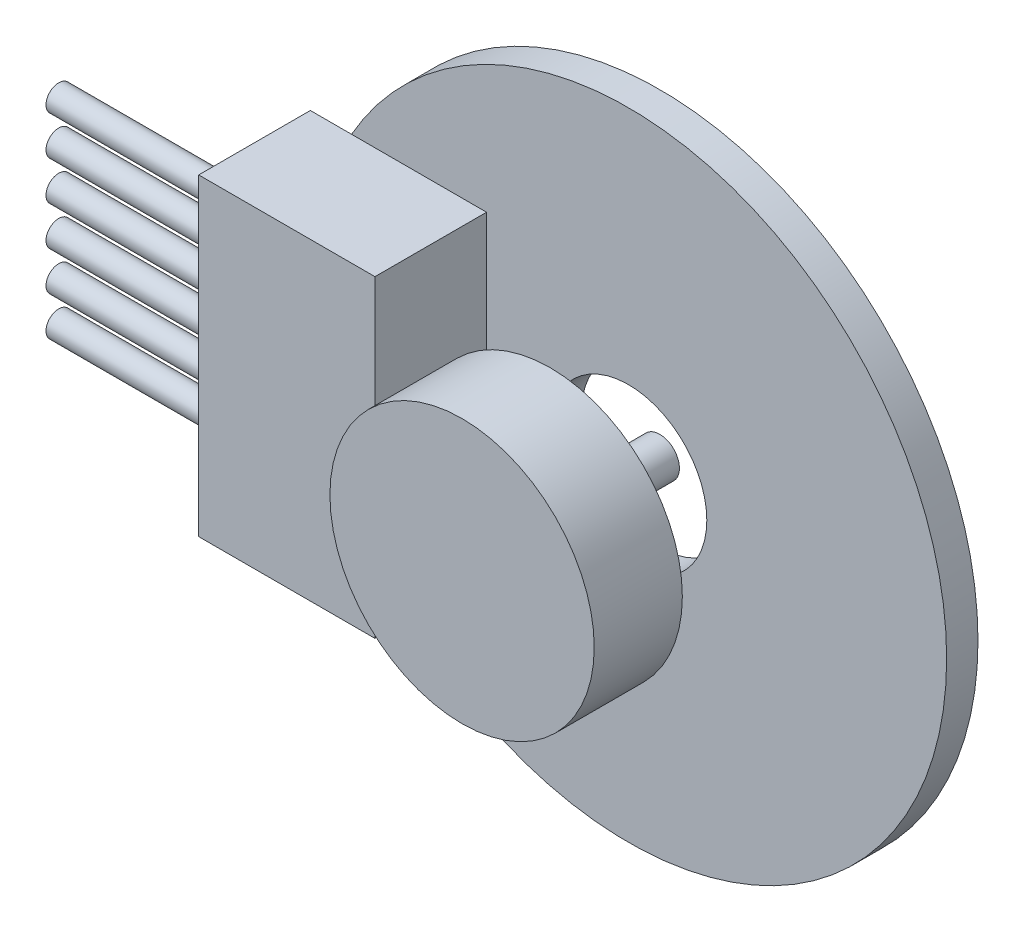
ISO-10303-21;
HEADER;
FILE_DESCRIPTION(('STEP AP214'),'2;1');
FILE_NAME('part.step','',(''),(''),'','','');
FILE_SCHEMA(('AUTOMOTIVE_DESIGN { 1 0 10303 214 1 1 1 1 }'));
ENDSEC;
DATA;
#1=APPLICATION_CONTEXT('core data for automotive mechanical design processes');
#2=APPLICATION_PROTOCOL_DEFINITION('international standard','automotive_design',2000,#1);
#3=PRODUCT_CONTEXT('',#1,'mechanical');
#4=PRODUCT('Part','Part','',(#3));
#5=PRODUCT_RELATED_PRODUCT_CATEGORY('part','',(#4));
#6=PRODUCT_DEFINITION_FORMATION('','',#4);
#7=PRODUCT_DEFINITION_CONTEXT('part definition',#1,'design');
#8=PRODUCT_DEFINITION('design','',#6,#7);
#9=PRODUCT_DEFINITION_SHAPE('','',#8);
#10=(LENGTH_UNIT() NAMED_UNIT(*) SI_UNIT(.MILLI.,.METRE.));
#11=(NAMED_UNIT(*) PLANE_ANGLE_UNIT() SI_UNIT($,.RADIAN.));
#12=(NAMED_UNIT(*) SI_UNIT($,.STERADIAN.) SOLID_ANGLE_UNIT());
#13=UNCERTAINTY_MEASURE_WITH_UNIT(LENGTH_MEASURE(1.E-05),#10,'distance_accuracy_value','');
#14=(GEOMETRIC_REPRESENTATION_CONTEXT(3) GLOBAL_UNCERTAINTY_ASSIGNED_CONTEXT((#13)) GLOBAL_UNIT_ASSIGNED_CONTEXT((#10,
#11,#12)) REPRESENTATION_CONTEXT('',''));
#15=CARTESIAN_POINT('',(0.,0.,0.));
#16=DIRECTION('',(0.,0.,1.));
#17=DIRECTION('',(1.,0.,0.));
#18=AXIS2_PLACEMENT_3D('',#15,#16,#17);
#19=CARTESIAN_POINT('',(0.,0.,5.6));
#20=DIRECTION('',(0.,0.,1.));
#21=DIRECTION('',(1.,0.,0.));
#22=AXIS2_PLACEMENT_3D('',#19,#20,#21);
#23=CYLINDRICAL_SURFACE('',#22,6.75);
#24=CARTESIAN_POINT('',(0.,0.,5.6));
#25=DIRECTION('',(0.,0.,1.));
#26=DIRECTION('',(1.,0.,0.));
#27=AXIS2_PLACEMENT_3D('',#24,#25,#26);
#28=CIRCLE('',#27,6.75);
#29=CARTESIAN_POINT('',(6.75,0.,5.6));
#30=VERTEX_POINT('',#29);
#31=EDGE_CURVE('E54',#30,#30,#28,.T.);
#32=ORIENTED_EDGE('',*,*,#31,.T.);
#33=EDGE_LOOP('',(#32));
#34=FACE_BOUND('',#33,.T.);
#35=CARTESIAN_POINT('',(0.,0.,10.1));
#36=DIRECTION('',(0.,0.,1.));
#37=DIRECTION('',(1.,0.,0.));
#38=AXIS2_PLACEMENT_3D('',#35,#36,#37);
#39=CIRCLE('',#38,6.75);
#40=CARTESIAN_POINT('',(6.75,0.,10.1));
#41=VERTEX_POINT('',#40);
#42=EDGE_CURVE('E50',#41,#41,#39,.T.);
#43=ORIENTED_EDGE('',*,*,#42,.F.);
#44=EDGE_LOOP('',(#43));
#45=FACE_BOUND('',#44,.T.);
#46=ADVANCED_FACE('F47',(#34,#45),#23,.T.);
#47=CARTESIAN_POINT('',(0.,0.,5.6));
#48=DIRECTION('',(0.,0.,1.));
#49=DIRECTION('',(1.,0.,0.));
#50=AXIS2_PLACEMENT_3D('',#47,#48,#49);
#51=PLANE('',#50);
#52=CARTESIAN_POINT('',(0.,0.,5.6));
#53=DIRECTION('',(0.,0.,-1.));
#54=DIRECTION('',(-1.,0.,0.));
#55=AXIS2_PLACEMENT_3D('',#52,#53,#54);
#56=CIRCLE('',#55,1.);
#57=CARTESIAN_POINT('',(-1.,0.,5.6));
#58=VERTEX_POINT('',#57);
#59=EDGE_CURVE('E11',#58,#58,#56,.T.);
#60=ORIENTED_EDGE('',*,*,#59,.F.);
#61=EDGE_LOOP('',(#60));
#62=FACE_BOUND('',#61,.T.);
#63=ORIENTED_EDGE('',*,*,#31,.F.);
#64=EDGE_LOOP('',(#63));
#65=FACE_BOUND('',#64,.T.);
#66=ADVANCED_FACE('F70',(#62,#65),#51,.F.);
#67=CARTESIAN_POINT('',(0.,0.,10.1));
#68=DIRECTION('',(0.,0.,1.));
#69=DIRECTION('',(1.,0.,0.));
#70=AXIS2_PLACEMENT_3D('',#67,#68,#69);
#71=PLANE('',#70);
#72=ORIENTED_EDGE('',*,*,#42,.T.);
#73=EDGE_LOOP('',(#72));
#74=FACE_BOUND('',#73,.T.);
#75=ADVANCED_FACE('F67',(#74),#71,.T.);
#76=CARTESIAN_POINT('',(0.,0.,-2.82842712474619));
#77=DIRECTION('',(0.,0.,1.));
#78=DIRECTION('',(1.,0.,0.));
#79=AXIS2_PLACEMENT_3D('',#76,#77,#78);
#80=CYLINDRICAL_SURFACE('',#79,1.);
#81=CARTESIAN_POINT('',(0.,0.,0.));
#82=DIRECTION('',(0.,0.,1.));
#83=DIRECTION('',(1.,0.,0.));
#84=AXIS2_PLACEMENT_3D('',#81,#82,#83);
#85=CIRCLE('',#84,1.);
#86=CARTESIAN_POINT('',(1.,0.,0.));
#87=VERTEX_POINT('',#86);
#88=EDGE_CURVE('E60',#87,#87,#85,.T.);
#89=ORIENTED_EDGE('',*,*,#88,.T.);
#90=EDGE_LOOP('',(#89));
#91=FACE_BOUND('',#90,.T.);
#92=ORIENTED_EDGE('',*,*,#59,.T.);
#93=EDGE_LOOP('',(#92));
#94=FACE_BOUND('',#93,.T.);
#95=ADVANCED_FACE('F82',(#91,#94),#80,.T.);
#96=CARTESIAN_POINT('',(0.,0.,0.));
#97=DIRECTION('',(0.,0.,1.));
#98=DIRECTION('',(1.,0.,0.));
#99=AXIS2_PLACEMENT_3D('',#96,#97,#98);
#100=PLANE('',#99);
#101=ORIENTED_EDGE('',*,*,#88,.F.);
#102=EDGE_LOOP('',(#101));
#103=FACE_BOUND('',#102,.T.);
#104=ADVANCED_FACE('F86',(#103),#100,.F.);
#105=CLOSED_SHELL('',(#46,#66,#75,#95,#104));
#106=MANIFOLD_SOLID_BREP('B2',#105);
#107=CARTESIAN_POINT('',(0.,0.,1.6));
#108=DIRECTION('',(0.,0.,1.));
#109=DIRECTION('',(1.,0.,0.));
#110=AXIS2_PLACEMENT_3D('',#107,#108,#109);
#111=PLANE('',#110);
#112=DIRECTION('',(1.,0.,0.));
#113=VECTOR('',#112,1.);
#114=CARTESIAN_POINT('',(-16.25,-8.,1.6));
#115=LINE('',#114,#113);
#116=CARTESIAN_POINT('',(-14.1443451598156,-8.,1.6));
#117=VERTEX_POINT('',#116);
#118=CARTESIAN_POINT('',(-7.25,-8.,1.6));
#119=VERTEX_POINT('',#118);
#120=EDGE_CURVE('E213',#117,#119,#115,.T.);
#121=ORIENTED_EDGE('',*,*,#120,.F.);
#122=CARTESIAN_POINT('',(0.,0.,1.6));
#123=DIRECTION('',(0.,0.,1.));
#124=DIRECTION('',(1.,0.,0.));
#125=AXIS2_PLACEMENT_3D('',#122,#123,#124);
#126=CIRCLE('',#125,16.25);
#127=CARTESIAN_POINT('',(-14.1443451598156,8.,1.6));
#128=VERTEX_POINT('',#127);
#129=EDGE_CURVE('E215',#117,#128,#126,.T.);
#130=ORIENTED_EDGE('',*,*,#129,.T.);
#131=DIRECTION('',(-1.,0.,0.));
#132=VECTOR('',#131,1.);
#133=CARTESIAN_POINT('',(-16.25,8.,1.6));
#134=LINE('',#133,#132);
#135=CARTESIAN_POINT('',(-7.25,8.,1.6));
#136=VERTEX_POINT('',#135);
#137=EDGE_CURVE('E147',#136,#128,#134,.T.);
#138=ORIENTED_EDGE('',*,*,#137,.F.);
#139=DIRECTION('',(0.,1.,0.));
#140=VECTOR('',#139,1.);
#141=CARTESIAN_POINT('',(-7.25,-8.,1.6));
#142=LINE('',#141,#140);
#143=EDGE_CURVE('E142',#119,#136,#142,.T.);
#144=ORIENTED_EDGE('',*,*,#143,.F.);
#145=EDGE_LOOP('',(#121,#130,#138,#144));
#146=FACE_BOUND('',#145,.T.);
#147=CARTESIAN_POINT('',(0.,0.,1.6));
#148=DIRECTION('',(0.,0.,1.));
#149=DIRECTION('',(1.,0.,0.));
#150=AXIS2_PLACEMENT_3D('',#147,#148,#149);
#151=CIRCLE('',#150,4.);
#152=CARTESIAN_POINT('',(4.,0.,1.6));
#153=VERTEX_POINT('',#152);
#154=EDGE_CURVE('E201',#153,#153,#151,.T.);
#155=ORIENTED_EDGE('',*,*,#154,.F.);
#156=EDGE_LOOP('',(#155));
#157=FACE_BOUND('',#156,.T.);
#158=ADVANCED_FACE('F127',(#146,#157),#111,.T.);
#159=CARTESIAN_POINT('',(0.,0.,0.));
#160=DIRECTION('',(0.,0.,1.));
#161=DIRECTION('',(1.,0.,0.));
#162=AXIS2_PLACEMENT_3D('',#159,#160,#161);
#163=PLANE('',#162);
#164=CARTESIAN_POINT('',(0.,0.,0.));
#165=DIRECTION('',(0.,0.,1.));
#166=DIRECTION('',(1.,0.,0.));
#167=AXIS2_PLACEMENT_3D('',#164,#165,#166);
#168=CIRCLE('',#167,16.25);
#169=CARTESIAN_POINT('',(16.25,0.,0.));
#170=VERTEX_POINT('',#169);
#171=EDGE_CURVE('E208',#170,#170,#168,.T.);
#172=ORIENTED_EDGE('',*,*,#171,.F.);
#173=EDGE_LOOP('',(#172));
#174=FACE_BOUND('',#173,.T.);
#175=CARTESIAN_POINT('',(0.,0.,0.));
#176=DIRECTION('',(0.,0.,1.));
#177=DIRECTION('',(1.,0.,0.));
#178=AXIS2_PLACEMENT_3D('',#175,#176,#177);
#179=CIRCLE('',#178,4.);
#180=CARTESIAN_POINT('',(4.,0.,0.));
#181=VERTEX_POINT('',#180);
#182=EDGE_CURVE('E198',#181,#181,#179,.T.);
#183=ORIENTED_EDGE('',*,*,#182,.T.);
#184=EDGE_LOOP('',(#183));
#185=FACE_BOUND('',#184,.T.);
#186=ADVANCED_FACE('F312',(#174,#185),#163,.F.);
#187=CARTESIAN_POINT('',(0.,0.,1.6));
#188=DIRECTION('',(0.,0.,-1.));
#189=DIRECTION('',(-1.,0.,0.));
#190=AXIS2_PLACEMENT_3D('',#187,#188,#189);
#191=CYLINDRICAL_SURFACE('',#190,16.25);
#192=CARTESIAN_POINT('',(-16.25,0.,1.6));
#193=VERTEX_POINT('',#192);
#194=EDGE_CURVE('E210',#128,#193,#126,.T.);
#195=ORIENTED_EDGE('',*,*,#194,.F.);
#196=ORIENTED_EDGE('',*,*,#129,.F.);
#197=EDGE_CURVE('E214',#193,#117,#126,.T.);
#198=ORIENTED_EDGE('',*,*,#197,.F.);
#199=EDGE_LOOP('',(#195,#196,#198));
#200=FACE_BOUND('',#199,.T.);
#201=ORIENTED_EDGE('',*,*,#171,.T.);
#202=EDGE_LOOP('',(#201));
#203=FACE_BOUND('',#202,.T.);
#204=ADVANCED_FACE('F129',(#200,#203),#191,.T.);
#205=CARTESIAN_POINT('',(0.,0.,1.6));
#206=DIRECTION('',(0.,0.,-1.));
#207=DIRECTION('',(-1.,0.,0.));
#208=AXIS2_PLACEMENT_3D('',#205,#206,#207);
#209=CYLINDRICAL_SURFACE('',#208,4.);
#210=ORIENTED_EDGE('',*,*,#154,.T.);
#211=EDGE_LOOP('',(#210));
#212=FACE_BOUND('',#211,.T.);
#213=ORIENTED_EDGE('',*,*,#182,.F.);
#214=EDGE_LOOP('',(#213));
#215=FACE_BOUND('',#214,.T.);
#216=ADVANCED_FACE('F319',(#212,#215),#209,.F.);
#217=CARTESIAN_POINT('',(0.,0.,1.6));
#218=DIRECTION('',(0.,0.,-1.));
#219=DIRECTION('',(-1.,0.,0.));
#220=AXIS2_PLACEMENT_3D('',#217,#218,#219);
#221=PLANE('',#220);
#222=CARTESIAN_POINT('',(-16.25,8.,1.6));
#223=VERTEX_POINT('',#222);
#224=EDGE_CURVE('E272',#128,#223,#134,.T.);
#225=ORIENTED_EDGE('',*,*,#224,.F.);
#226=ORIENTED_EDGE('',*,*,#194,.T.);
#227=DIRECTION('',(0.,-1.,0.));
#228=VECTOR('',#227,1.);
#229=CARTESIAN_POINT('',(-16.25,-8.,1.6));
#230=LINE('',#229,#228);
#231=EDGE_CURVE('E250',#223,#193,#230,.T.);
#232=ORIENTED_EDGE('',*,*,#231,.F.);
#233=EDGE_LOOP('',(#225,#226,#232));
#234=FACE_BOUND('',#233,.T.);
#235=ADVANCED_FACE('F273',(#234),#221,.T.);
#236=CARTESIAN_POINT('',(-7.25,-8.,7.3));
#237=DIRECTION('',(-1.,0.,0.));
#238=DIRECTION('',(0.,0.,1.));
#239=AXIS2_PLACEMENT_3D('',#236,#237,#238);
#240=PLANE('',#239);
#241=ORIENTED_EDGE('',*,*,#143,.T.);
#242=DIRECTION('',(0.,0.,-1.));
#243=VECTOR('',#242,1.);
#244=CARTESIAN_POINT('',(-7.25,8.,7.3));
#245=LINE('',#244,#243);
#246=CARTESIAN_POINT('',(-7.25,8.,7.3));
#247=VERTEX_POINT('',#246);
#248=EDGE_CURVE('E180',#247,#136,#245,.T.);
#249=ORIENTED_EDGE('',*,*,#248,.F.);
#250=DIRECTION('',(0.,1.,0.));
#251=VECTOR('',#250,1.);
#252=CARTESIAN_POINT('',(-7.25,-8.,7.3));
#253=LINE('',#252,#251);
#254=CARTESIAN_POINT('',(-7.25,-8.,7.3));
#255=VERTEX_POINT('',#254);
#256=EDGE_CURVE('E186',#255,#247,#253,.T.);
#257=ORIENTED_EDGE('',*,*,#256,.F.);
#258=DIRECTION('',(0.,0.,-1.));
#259=VECTOR('',#258,1.);
#260=CARTESIAN_POINT('',(-7.25,-8.,7.3));
#261=LINE('',#260,#259);
#262=EDGE_CURVE('E263',#255,#119,#261,.T.);
#263=ORIENTED_EDGE('',*,*,#262,.T.);
#264=EDGE_LOOP('',(#241,#249,#257,#263));
#265=FACE_BOUND('',#264,.T.);
#266=ADVANCED_FACE('F197',(#265),#240,.F.);
#267=CARTESIAN_POINT('',(-16.25,8.,7.3));
#268=DIRECTION('',(0.,-1.,0.));
#269=DIRECTION('',(0.,0.,-1.));
#270=AXIS2_PLACEMENT_3D('',#267,#268,#269);
#271=PLANE('',#270);
#272=ORIENTED_EDGE('',*,*,#137,.T.);
#273=ORIENTED_EDGE('',*,*,#224,.T.);
#274=DIRECTION('',(0.,0.,-1.));
#275=VECTOR('',#274,1.);
#276=CARTESIAN_POINT('',(-16.25,8.,7.3));
#277=LINE('',#276,#275);
#278=CARTESIAN_POINT('',(-16.25,8.,7.3));
#279=VERTEX_POINT('',#278);
#280=EDGE_CURVE('E182',#279,#223,#277,.T.);
#281=ORIENTED_EDGE('',*,*,#280,.F.);
#282=DIRECTION('',(-1.,0.,0.));
#283=VECTOR('',#282,1.);
#284=CARTESIAN_POINT('',(-16.25,8.,7.3));
#285=LINE('',#284,#283);
#286=EDGE_CURVE('E176',#247,#279,#285,.T.);
#287=ORIENTED_EDGE('',*,*,#286,.F.);
#288=ORIENTED_EDGE('',*,*,#248,.T.);
#289=EDGE_LOOP('',(#272,#273,#281,#287,#288));
#290=FACE_BOUND('',#289,.T.);
#291=ADVANCED_FACE('F178',(#290),#271,.F.);
#292=CARTESIAN_POINT('',(-16.25,-8.,7.3));
#293=DIRECTION('',(1.,0.,0.));
#294=DIRECTION('',(0.,0.,-1.));
#295=AXIS2_PLACEMENT_3D('',#292,#293,#294);
#296=PLANE('',#295);
#297=CARTESIAN_POINT('',(-16.25,-5.,4.45000000000004));
#298=DIRECTION('',(1.,0.,0.));
#299=DIRECTION('',(0.,0.,-1.));
#300=AXIS2_PLACEMENT_3D('',#297,#298,#299);
#301=CIRCLE('',#300,0.65);
#302=CARTESIAN_POINT('',(-16.25,-5.,3.80000000000004));
#303=VERTEX_POINT('',#302);
#304=EDGE_CURVE('E45',#303,#303,#301,.F.);
#305=ORIENTED_EDGE('',*,*,#304,.F.);
#306=EDGE_LOOP('',(#305));
#307=FACE_BOUND('',#306,.T.);
#308=CARTESIAN_POINT('',(-16.25,-3.,4.45000000000002));
#309=DIRECTION('',(1.,0.,0.));
#310=DIRECTION('',(0.,0.,-1.));
#311=AXIS2_PLACEMENT_3D('',#308,#309,#310);
#312=CIRCLE('',#311,0.65);
#313=CARTESIAN_POINT('',(-16.25,-3.,3.80000000000002));
#314=VERTEX_POINT('',#313);
#315=EDGE_CURVE('E135',#314,#314,#312,.F.);
#316=ORIENTED_EDGE('',*,*,#315,.F.);
#317=EDGE_LOOP('',(#316));
#318=FACE_BOUND('',#317,.T.);
#319=CARTESIAN_POINT('',(-16.25,-1.,4.45));
#320=DIRECTION('',(1.,0.,0.));
#321=DIRECTION('',(0.,0.,-1.));
#322=AXIS2_PLACEMENT_3D('',#319,#320,#321);
#323=CIRCLE('',#322,0.65);
#324=CARTESIAN_POINT('',(-16.25,-1.,3.8));
#325=VERTEX_POINT('',#324);
#326=EDGE_CURVE('E227',#325,#325,#323,.F.);
#327=ORIENTED_EDGE('',*,*,#326,.F.);
#328=EDGE_LOOP('',(#327));
#329=FACE_BOUND('',#328,.T.);
#330=CARTESIAN_POINT('',(-16.25,0.999999999999997,4.44999999999998));
#331=DIRECTION('',(1.,0.,0.));
#332=DIRECTION('',(0.,0.,-1.));
#333=AXIS2_PLACEMENT_3D('',#330,#331,#332);
#334=CIRCLE('',#333,0.65);
#335=CARTESIAN_POINT('',(-16.25,0.999999999999997,3.79999999999998));
#336=VERTEX_POINT('',#335);
#337=EDGE_CURVE('E224',#336,#336,#334,.F.);
#338=ORIENTED_EDGE('',*,*,#337,.F.);
#339=EDGE_LOOP('',(#338));
#340=FACE_BOUND('',#339,.T.);
#341=CARTESIAN_POINT('',(-16.25,3.,4.44999999999996));
#342=DIRECTION('',(1.,0.,0.));
#343=DIRECTION('',(0.,0.,-1.));
#344=AXIS2_PLACEMENT_3D('',#341,#342,#343);
#345=CIRCLE('',#344,0.65);
#346=CARTESIAN_POINT('',(-16.25,3.,3.79999999999996));
#347=VERTEX_POINT('',#346);
#348=EDGE_CURVE('E221',#347,#347,#345,.F.);
#349=ORIENTED_EDGE('',*,*,#348,.F.);
#350=EDGE_LOOP('',(#349));
#351=FACE_BOUND('',#350,.T.);
#352=CARTESIAN_POINT('',(-16.25,5.,4.44999999999994));
#353=DIRECTION('',(1.,0.,0.));
#354=DIRECTION('',(0.,0.,-1.));
#355=AXIS2_PLACEMENT_3D('',#352,#353,#354);
#356=CIRCLE('',#355,0.65);
#357=CARTESIAN_POINT('',(-16.25,5.,3.79999999999994));
#358=VERTEX_POINT('',#357);
#359=EDGE_CURVE('E218',#358,#358,#356,.F.);
#360=ORIENTED_EDGE('',*,*,#359,.F.);
#361=EDGE_LOOP('',(#360));
#362=FACE_BOUND('',#361,.T.);
#363=ORIENTED_EDGE('',*,*,#231,.T.);
#364=CARTESIAN_POINT('',(-16.25,-8.,1.6));
#365=VERTEX_POINT('',#364);
#366=EDGE_CURVE('E253',#193,#365,#230,.T.);
#367=ORIENTED_EDGE('',*,*,#366,.T.);
#368=DIRECTION('',(0.,0.,-1.));
#369=VECTOR('',#368,1.);
#370=CARTESIAN_POINT('',(-16.25,-8.,7.3));
#371=LINE('',#370,#369);
#372=CARTESIAN_POINT('',(-16.25,-8.,7.3));
#373=VERTEX_POINT('',#372);
#374=EDGE_CURVE('E203',#373,#365,#371,.T.);
#375=ORIENTED_EDGE('',*,*,#374,.F.);
#376=DIRECTION('',(0.,-1.,0.));
#377=VECTOR('',#376,1.);
#378=CARTESIAN_POINT('',(-16.25,-8.,7.3));
#379=LINE('',#378,#377);
#380=EDGE_CURVE('E185',#279,#373,#379,.T.);
#381=ORIENTED_EDGE('',*,*,#380,.F.);
#382=ORIENTED_EDGE('',*,*,#280,.T.);
#383=EDGE_LOOP('',(#363,#367,#375,#381,#382));
#384=FACE_BOUND('',#383,.T.);
#385=ADVANCED_FACE('F234',(#307,#318,#329,#340,#351,#362,#384),#296,.F.);
#386=CARTESIAN_POINT('',(-16.25,-8.,7.3));
#387=DIRECTION('',(0.,1.,0.));
#388=DIRECTION('',(0.,0.,1.));
#389=AXIS2_PLACEMENT_3D('',#386,#387,#388);
#390=PLANE('',#389);
#391=EDGE_CURVE('E195',#365,#117,#115,.T.);
#392=ORIENTED_EDGE('',*,*,#391,.T.);
#393=ORIENTED_EDGE('',*,*,#120,.T.);
#394=ORIENTED_EDGE('',*,*,#262,.F.);
#395=DIRECTION('',(1.,0.,0.));
#396=VECTOR('',#395,1.);
#397=CARTESIAN_POINT('',(-16.25,-8.,7.3));
#398=LINE('',#397,#396);
#399=EDGE_CURVE('E191',#373,#255,#398,.T.);
#400=ORIENTED_EDGE('',*,*,#399,.F.);
#401=ORIENTED_EDGE('',*,*,#374,.T.);
#402=EDGE_LOOP('',(#392,#393,#394,#400,#401));
#403=FACE_BOUND('',#402,.T.);
#404=ADVANCED_FACE('F237',(#403),#390,.F.);
#405=CARTESIAN_POINT('',(0.,0.,7.3));
#406=DIRECTION('',(0.,0.,-1.));
#407=DIRECTION('',(-1.,0.,0.));
#408=AXIS2_PLACEMENT_3D('',#405,#406,#407);
#409=PLANE('',#408);
#410=ORIENTED_EDGE('',*,*,#256,.T.);
#411=ORIENTED_EDGE('',*,*,#286,.T.);
#412=ORIENTED_EDGE('',*,*,#380,.T.);
#413=ORIENTED_EDGE('',*,*,#399,.T.);
#414=EDGE_LOOP('',(#410,#411,#412,#413));
#415=FACE_BOUND('',#414,.T.);
#416=ADVANCED_FACE('F189',(#415),#409,.F.);
#417=ORIENTED_EDGE('',*,*,#366,.F.);
#418=ORIENTED_EDGE('',*,*,#197,.T.);
#419=ORIENTED_EDGE('',*,*,#391,.F.);
#420=EDGE_LOOP('',(#417,#418,#419));
#421=FACE_BOUND('',#420,.T.);
#422=ADVANCED_FACE('F268',(#421),#221,.T.);
#423=CARTESIAN_POINT('',(-26.25,5.,4.44999999999994));
#424=DIRECTION('',(1.,0.,0.));
#425=DIRECTION('',(0.,0.,-1.));
#426=AXIS2_PLACEMENT_3D('',#423,#424,#425);
#427=CYLINDRICAL_SURFACE('',#426,0.65);
#428=CARTESIAN_POINT('',(-26.25,5.,4.44999999999994));
#429=DIRECTION('',(-1.,0.,0.));
#430=DIRECTION('',(0.,0.,1.));
#431=AXIS2_PLACEMENT_3D('',#428,#429,#430);
#432=CIRCLE('',#431,0.65);
#433=CARTESIAN_POINT('',(-26.25,5.,5.09999999999994));
#434=VERTEX_POINT('',#433);
#435=EDGE_CURVE('E274',#434,#434,#432,.T.);
#436=ORIENTED_EDGE('',*,*,#435,.F.);
#437=EDGE_LOOP('',(#436));
#438=FACE_BOUND('',#437,.T.);
#439=ORIENTED_EDGE('',*,*,#359,.T.);
#440=EDGE_LOOP('',(#439));
#441=FACE_BOUND('',#440,.T.);
#442=ADVANCED_FACE('F331',(#438,#441),#427,.T.);
#443=CARTESIAN_POINT('',(-26.25,5.,4.44999999999994));
#444=DIRECTION('',(-1.,0.,0.));
#445=DIRECTION('',(0.,0.,1.));
#446=AXIS2_PLACEMENT_3D('',#443,#444,#445);
#447=PLANE('',#446);
#448=ORIENTED_EDGE('',*,*,#435,.T.);
#449=EDGE_LOOP('',(#448));
#450=FACE_BOUND('',#449,.T.);
#451=ADVANCED_FACE('F336',(#450),#447,.T.);
#452=CARTESIAN_POINT('',(-26.25,3.,4.44999999999996));
#453=DIRECTION('',(1.,0.,0.));
#454=DIRECTION('',(0.,0.,-1.));
#455=AXIS2_PLACEMENT_3D('',#452,#453,#454);
#456=CYLINDRICAL_SURFACE('',#455,0.65);
#457=CARTESIAN_POINT('',(-26.25,3.,4.44999999999996));
#458=DIRECTION('',(-1.,0.,0.));
#459=DIRECTION('',(0.,0.,1.));
#460=AXIS2_PLACEMENT_3D('',#457,#458,#459);
#461=CIRCLE('',#460,0.65);
#462=CARTESIAN_POINT('',(-26.25,3.,5.09999999999996));
#463=VERTEX_POINT('',#462);
#464=EDGE_CURVE('E276',#463,#463,#461,.T.);
#465=ORIENTED_EDGE('',*,*,#464,.F.);
#466=EDGE_LOOP('',(#465));
#467=FACE_BOUND('',#466,.T.);
#468=ORIENTED_EDGE('',*,*,#348,.T.);
#469=EDGE_LOOP('',(#468));
#470=FACE_BOUND('',#469,.T.);
#471=ADVANCED_FACE('F340',(#467,#470),#456,.T.);
#472=CARTESIAN_POINT('',(-26.25,3.,4.44999999999996));
#473=DIRECTION('',(-1.,0.,0.));
#474=DIRECTION('',(0.,0.,1.));
#475=AXIS2_PLACEMENT_3D('',#472,#473,#474);
#476=PLANE('',#475);
#477=ORIENTED_EDGE('',*,*,#464,.T.);
#478=EDGE_LOOP('',(#477));
#479=FACE_BOUND('',#478,.T.);
#480=ADVANCED_FACE('F342',(#479),#476,.T.);
#481=CARTESIAN_POINT('',(-26.25,0.999999999999997,4.44999999999998));
#482=DIRECTION('',(1.,0.,0.));
#483=DIRECTION('',(0.,0.,-1.));
#484=AXIS2_PLACEMENT_3D('',#481,#482,#483);
#485=CYLINDRICAL_SURFACE('',#484,0.65);
#486=CARTESIAN_POINT('',(-26.25,0.999999999999997,4.44999999999998));
#487=DIRECTION('',(-1.,0.,0.));
#488=DIRECTION('',(0.,0.,1.));
#489=AXIS2_PLACEMENT_3D('',#486,#487,#488);
#490=CIRCLE('',#489,0.65);
#491=CARTESIAN_POINT('',(-26.25,0.999999999999997,5.09999999999998));
#492=VERTEX_POINT('',#491);
#493=EDGE_CURVE('E283',#492,#492,#490,.T.);
#494=ORIENTED_EDGE('',*,*,#493,.F.);
#495=EDGE_LOOP('',(#494));
#496=FACE_BOUND('',#495,.T.);
#497=ORIENTED_EDGE('',*,*,#337,.T.);
#498=EDGE_LOOP('',(#497));
#499=FACE_BOUND('',#498,.T.);
#500=ADVANCED_FACE('F345',(#496,#499),#485,.T.);
#501=CARTESIAN_POINT('',(-26.25,0.999999999999997,4.44999999999998));
#502=DIRECTION('',(-1.,0.,0.));
#503=DIRECTION('',(0.,0.,1.));
#504=AXIS2_PLACEMENT_3D('',#501,#502,#503);
#505=PLANE('',#504);
#506=ORIENTED_EDGE('',*,*,#493,.T.);
#507=EDGE_LOOP('',(#506));
#508=FACE_BOUND('',#507,.T.);
#509=ADVANCED_FACE('F350',(#508),#505,.T.);
#510=CARTESIAN_POINT('',(-26.25,-1.,4.45));
#511=DIRECTION('',(1.,0.,0.));
#512=DIRECTION('',(0.,0.,-1.));
#513=AXIS2_PLACEMENT_3D('',#510,#511,#512);
#514=CYLINDRICAL_SURFACE('',#513,0.65);
#515=CARTESIAN_POINT('',(-26.25,-1.,4.45));
#516=DIRECTION('',(-1.,0.,0.));
#517=DIRECTION('',(0.,0.,1.));
#518=AXIS2_PLACEMENT_3D('',#515,#516,#517);
#519=CIRCLE('',#518,0.65);
#520=CARTESIAN_POINT('',(-26.25,-1.,5.1));
#521=VERTEX_POINT('',#520);
#522=EDGE_CURVE('E286',#521,#521,#519,.T.);
#523=ORIENTED_EDGE('',*,*,#522,.F.);
#524=EDGE_LOOP('',(#523));
#525=FACE_BOUND('',#524,.T.);
#526=ORIENTED_EDGE('',*,*,#326,.T.);
#527=EDGE_LOOP('',(#526));
#528=FACE_BOUND('',#527,.T.);
#529=ADVANCED_FACE('F353',(#525,#528),#514,.T.);
#530=CARTESIAN_POINT('',(-26.25,-1.,4.45));
#531=DIRECTION('',(-1.,0.,0.));
#532=DIRECTION('',(0.,0.,1.));
#533=AXIS2_PLACEMENT_3D('',#530,#531,#532);
#534=PLANE('',#533);
#535=ORIENTED_EDGE('',*,*,#522,.T.);
#536=EDGE_LOOP('',(#535));
#537=FACE_BOUND('',#536,.T.);
#538=ADVANCED_FACE('F358',(#537),#534,.T.);
#539=CARTESIAN_POINT('',(-26.25,-3.,4.45000000000002));
#540=DIRECTION('',(1.,0.,0.));
#541=DIRECTION('',(0.,0.,-1.));
#542=AXIS2_PLACEMENT_3D('',#539,#540,#541);
#543=CYLINDRICAL_SURFACE('',#542,0.65);
#544=CARTESIAN_POINT('',(-26.25,-3.,4.45000000000002));
#545=DIRECTION('',(-1.,0.,0.));
#546=DIRECTION('',(0.,0.,1.));
#547=AXIS2_PLACEMENT_3D('',#544,#545,#546);
#548=CIRCLE('',#547,0.65);
#549=CARTESIAN_POINT('',(-26.25,-3.,5.10000000000002));
#550=VERTEX_POINT('',#549);
#551=EDGE_CURVE('E289',#550,#550,#548,.T.);
#552=ORIENTED_EDGE('',*,*,#551,.F.);
#553=EDGE_LOOP('',(#552));
#554=FACE_BOUND('',#553,.T.);
#555=ORIENTED_EDGE('',*,*,#315,.T.);
#556=EDGE_LOOP('',(#555));
#557=FACE_BOUND('',#556,.T.);
#558=ADVANCED_FACE('F232',(#554,#557),#543,.T.);
#559=CARTESIAN_POINT('',(-26.25,-3.,4.45000000000002));
#560=DIRECTION('',(-1.,0.,0.));
#561=DIRECTION('',(0.,0.,1.));
#562=AXIS2_PLACEMENT_3D('',#559,#560,#561);
#563=PLANE('',#562);
#564=ORIENTED_EDGE('',*,*,#551,.T.);
#565=EDGE_LOOP('',(#564));
#566=FACE_BOUND('',#565,.T.);
#567=ADVANCED_FACE('F301',(#566),#563,.T.);
#568=CARTESIAN_POINT('',(-26.25,-5.,4.45000000000004));
#569=DIRECTION('',(1.,0.,0.));
#570=DIRECTION('',(0.,0.,-1.));
#571=AXIS2_PLACEMENT_3D('',#568,#569,#570);
#572=CYLINDRICAL_SURFACE('',#571,0.65);
#573=CARTESIAN_POINT('',(-26.25,-5.,4.45000000000004));
#574=DIRECTION('',(-1.,0.,0.));
#575=DIRECTION('',(0.,0.,1.));
#576=AXIS2_PLACEMENT_3D('',#573,#574,#575);
#577=CIRCLE('',#576,0.65);
#578=CARTESIAN_POINT('',(-26.25,-5.,5.10000000000004));
#579=VERTEX_POINT('',#578);
#580=EDGE_CURVE('E292',#579,#579,#577,.T.);
#581=ORIENTED_EDGE('',*,*,#580,.F.);
#582=EDGE_LOOP('',(#581));
#583=FACE_BOUND('',#582,.T.);
#584=ORIENTED_EDGE('',*,*,#304,.T.);
#585=EDGE_LOOP('',(#584));
#586=FACE_BOUND('',#585,.T.);
#587=ADVANCED_FACE('F298',(#583,#586),#572,.T.);
#588=CARTESIAN_POINT('',(-26.25,-5.,4.45000000000004));
#589=DIRECTION('',(-1.,0.,0.));
#590=DIRECTION('',(0.,0.,1.));
#591=AXIS2_PLACEMENT_3D('',#588,#589,#590);
#592=PLANE('',#591);
#593=ORIENTED_EDGE('',*,*,#580,.T.);
#594=EDGE_LOOP('',(#593));
#595=FACE_BOUND('',#594,.T.);
#596=ADVANCED_FACE('F296',(#595),#592,.T.);
#597=CLOSED_SHELL('',(#158,#186,#204,#216,#235,#266,#291,#385,#404,#416,#422,#442,#451,#471,
#480,#500,#509,#529,#538,#558,#567,#587,#596));
#598=MANIFOLD_SOLID_BREP('B6',#597);
#599=ADVANCED_BREP_SHAPE_REPRESENTATION('',(#18,#106,#598),#14);
#600=SHAPE_DEFINITION_REPRESENTATION(#9,#599);
ENDSEC;
END-ISO-10303-21;
